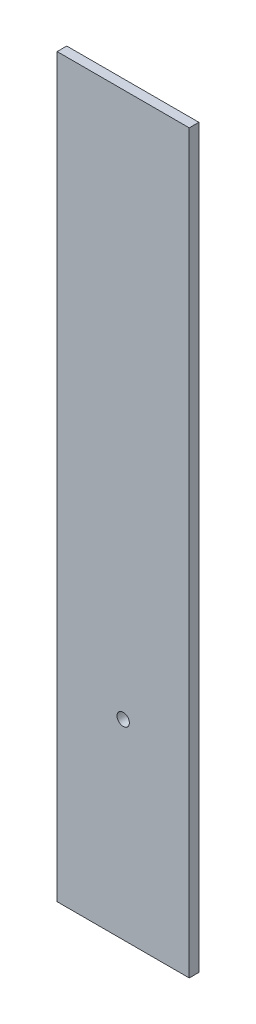
ISO-10303-21;
HEADER;
FILE_DESCRIPTION(('STEP AP214'),'2;1');
FILE_NAME('part.step','',(''),(''),'','','');
FILE_SCHEMA(('AUTOMOTIVE_DESIGN { 1 0 10303 214 1 1 1 1 }'));
ENDSEC;
DATA;
#1=APPLICATION_CONTEXT('core data for automotive mechanical design processes');
#2=APPLICATION_PROTOCOL_DEFINITION('international standard','automotive_design',2000,#1);
#3=PRODUCT_CONTEXT('',#1,'mechanical');
#4=PRODUCT('Part','Part','',(#3));
#5=PRODUCT_RELATED_PRODUCT_CATEGORY('part','',(#4));
#6=PRODUCT_DEFINITION_FORMATION('','',#4);
#7=PRODUCT_DEFINITION_CONTEXT('part definition',#1,'design');
#8=PRODUCT_DEFINITION('design','',#6,#7);
#9=PRODUCT_DEFINITION_SHAPE('','',#8);
#10=(LENGTH_UNIT() NAMED_UNIT(*) SI_UNIT(.MILLI.,.METRE.));
#11=(NAMED_UNIT(*) PLANE_ANGLE_UNIT() SI_UNIT($,.RADIAN.));
#12=(NAMED_UNIT(*) SI_UNIT($,.STERADIAN.) SOLID_ANGLE_UNIT());
#13=UNCERTAINTY_MEASURE_WITH_UNIT(LENGTH_MEASURE(1.E-05),#10,'distance_accuracy_value','');
#14=(GEOMETRIC_REPRESENTATION_CONTEXT(3) GLOBAL_UNCERTAINTY_ASSIGNED_CONTEXT((#13)) GLOBAL_UNIT_ASSIGNED_CONTEXT((#10,
#11,#12)) REPRESENTATION_CONTEXT('',''));
#15=CARTESIAN_POINT('',(0.,0.,0.));
#16=DIRECTION('',(0.,0.,1.));
#17=DIRECTION('',(1.,0.,0.));
#18=AXIS2_PLACEMENT_3D('',#15,#16,#17);
#19=CARTESIAN_POINT('',(0.,0.,4.953));
#20=DIRECTION('',(0.,0.,1.));
#21=DIRECTION('',(1.,0.,0.));
#22=AXIS2_PLACEMENT_3D('',#19,#20,#21);
#23=PLANE('',#22);
#24=DIRECTION('',(0.,-1.,0.));
#25=VECTOR('',#24,1.);
#26=CARTESIAN_POINT('',(-34.0000000000004,394.959461551983,4.953));
#27=LINE('',#26,#25);
#28=CARTESIAN_POINT('',(-34.0000000000004,394.959461551983,4.953));
#29=VERTEX_POINT('',#28);
#30=CARTESIAN_POINT('',(-34.0000000000003,16.,4.953));
#31=VERTEX_POINT('',#30);
#32=EDGE_CURVE('E85',#29,#31,#27,.T.);
#33=ORIENTED_EDGE('',*,*,#32,.T.);
#34=DIRECTION('',(1.,0.,0.));
#35=VECTOR('',#34,1.);
#36=CARTESIAN_POINT('',(-34.0000000000003,16.,4.953));
#37=LINE('',#36,#35);
#38=CARTESIAN_POINT('',(33.9999999999997,16.,4.953));
#39=VERTEX_POINT('',#38);
#40=EDGE_CURVE('E80',#31,#39,#37,.T.);
#41=ORIENTED_EDGE('',*,*,#40,.T.);
#42=DIRECTION('',(0.,1.,0.));
#43=VECTOR('',#42,1.);
#44=CARTESIAN_POINT('',(33.9999999999996,394.959461551983,4.953));
#45=LINE('',#44,#43);
#46=CARTESIAN_POINT('',(33.9999999999996,394.959461551983,4.953));
#47=VERTEX_POINT('',#46);
#48=EDGE_CURVE('E83',#39,#47,#45,.T.);
#49=ORIENTED_EDGE('',*,*,#48,.T.);
#50=DIRECTION('',(-1.,0.,0.));
#51=VECTOR('',#50,1.);
#52=CARTESIAN_POINT('',(-34.0000000000004,394.959461551983,4.953));
#53=LINE('',#52,#51);
#54=EDGE_CURVE('E50',#47,#29,#53,.T.);
#55=ORIENTED_EDGE('',*,*,#54,.T.);
#56=EDGE_LOOP('',(#33,#41,#49,#55));
#57=FACE_BOUND('',#56,.T.);
#58=CARTESIAN_POINT('',(0.,114.3,4.953));
#59=DIRECTION('',(0.,0.,1.));
#60=DIRECTION('',(1.,0.,0.));
#61=AXIS2_PLACEMENT_3D('',#58,#59,#60);
#62=CIRCLE('',#61,3.175);
#63=CARTESIAN_POINT('',(3.17499999999997,114.3,4.953));
#64=VERTEX_POINT('',#63);
#65=EDGE_CURVE('E100',#64,#64,#62,.T.);
#66=ORIENTED_EDGE('',*,*,#65,.F.);
#67=EDGE_LOOP('',(#66));
#68=FACE_BOUND('',#67,.T.);
#69=ADVANCED_FACE('F33',(#57,#68),#23,.T.);
#70=CARTESIAN_POINT('',(0.,0.,0.));
#71=DIRECTION('',(0.,0.,1.));
#72=DIRECTION('',(1.,0.,0.));
#73=AXIS2_PLACEMENT_3D('',#70,#71,#72);
#74=PLANE('',#73);
#75=DIRECTION('',(0.,-1.,0.));
#76=VECTOR('',#75,1.);
#77=CARTESIAN_POINT('',(-34.0000000000004,394.959461551983,0.));
#78=LINE('',#77,#76);
#79=CARTESIAN_POINT('',(-34.0000000000004,394.959461551983,0.));
#80=VERTEX_POINT('',#79);
#81=CARTESIAN_POINT('',(-34.0000000000003,16.,0.));
#82=VERTEX_POINT('',#81);
#83=EDGE_CURVE('E97',#80,#82,#78,.T.);
#84=ORIENTED_EDGE('',*,*,#83,.F.);
#85=DIRECTION('',(-1.,0.,0.));
#86=VECTOR('',#85,1.);
#87=CARTESIAN_POINT('',(-34.0000000000004,394.959461551983,0.));
#88=LINE('',#87,#86);
#89=CARTESIAN_POINT('',(33.9999999999996,394.959461551983,0.));
#90=VERTEX_POINT('',#89);
#91=EDGE_CURVE('E73',#90,#80,#88,.T.);
#92=ORIENTED_EDGE('',*,*,#91,.F.);
#93=DIRECTION('',(0.,1.,0.));
#94=VECTOR('',#93,1.);
#95=CARTESIAN_POINT('',(33.9999999999996,394.959461551983,0.));
#96=LINE('',#95,#94);
#97=CARTESIAN_POINT('',(33.9999999999997,16.,0.));
#98=VERTEX_POINT('',#97);
#99=EDGE_CURVE('E67',#98,#90,#96,.T.);
#100=ORIENTED_EDGE('',*,*,#99,.F.);
#101=DIRECTION('',(1.,0.,0.));
#102=VECTOR('',#101,1.);
#103=CARTESIAN_POINT('',(-34.0000000000003,16.,0.));
#104=LINE('',#103,#102);
#105=EDGE_CURVE('E89',#82,#98,#104,.T.);
#106=ORIENTED_EDGE('',*,*,#105,.F.);
#107=EDGE_LOOP('',(#84,#92,#100,#106));
#108=FACE_BOUND('',#107,.T.);
#109=CARTESIAN_POINT('',(0.,114.3,0.));
#110=DIRECTION('',(0.,0.,1.));
#111=DIRECTION('',(1.,0.,0.));
#112=AXIS2_PLACEMENT_3D('',#109,#110,#111);
#113=CIRCLE('',#112,3.175);
#114=CARTESIAN_POINT('',(3.17499999999997,114.3,0.));
#115=VERTEX_POINT('',#114);
#116=EDGE_CURVE('E112',#115,#115,#113,.T.);
#117=ORIENTED_EDGE('',*,*,#116,.T.);
#118=EDGE_LOOP('',(#117));
#119=FACE_BOUND('',#118,.T.);
#120=ADVANCED_FACE('F108',(#108,#119),#74,.F.);
#121=CARTESIAN_POINT('',(-34.0000000000004,394.959461551983,4.953));
#122=DIRECTION('',(1.,0.,0.));
#123=DIRECTION('',(0.,1.,0.));
#124=AXIS2_PLACEMENT_3D('',#121,#122,#123);
#125=PLANE('',#124);
#126=ORIENTED_EDGE('',*,*,#83,.T.);
#127=DIRECTION('',(0.,0.,-1.));
#128=VECTOR('',#127,1.);
#129=CARTESIAN_POINT('',(-34.0000000000003,16.,4.953));
#130=LINE('',#129,#128);
#131=EDGE_CURVE('E11',#31,#82,#130,.T.);
#132=ORIENTED_EDGE('',*,*,#131,.F.);
#133=ORIENTED_EDGE('',*,*,#32,.F.);
#134=DIRECTION('',(0.,0.,-1.));
#135=VECTOR('',#134,1.);
#136=CARTESIAN_POINT('',(-34.0000000000004,394.959461551983,4.953));
#137=LINE('',#136,#135);
#138=EDGE_CURVE('E93',#29,#80,#137,.T.);
#139=ORIENTED_EDGE('',*,*,#138,.T.);
#140=EDGE_LOOP('',(#126,#132,#133,#139));
#141=FACE_BOUND('',#140,.T.);
#142=ADVANCED_FACE('F35',(#141),#125,.F.);
#143=CARTESIAN_POINT('',(-34.0000000000003,16.,4.953));
#144=DIRECTION('',(0.,1.,0.));
#145=DIRECTION('',(-1.,0.,0.));
#146=AXIS2_PLACEMENT_3D('',#143,#144,#145);
#147=PLANE('',#146);
#148=ORIENTED_EDGE('',*,*,#105,.T.);
#149=DIRECTION('',(0.,0.,-1.));
#150=VECTOR('',#149,1.);
#151=CARTESIAN_POINT('',(33.9999999999997,16.,4.953));
#152=LINE('',#151,#150);
#153=EDGE_CURVE('E42',#39,#98,#152,.T.);
#154=ORIENTED_EDGE('',*,*,#153,.F.);
#155=ORIENTED_EDGE('',*,*,#40,.F.);
#156=ORIENTED_EDGE('',*,*,#131,.T.);
#157=EDGE_LOOP('',(#148,#154,#155,#156));
#158=FACE_BOUND('',#157,.T.);
#159=ADVANCED_FACE('F88',(#158),#147,.F.);
#160=CARTESIAN_POINT('',(33.9999999999996,394.959461551983,4.953));
#161=DIRECTION('',(-1.,0.,0.));
#162=DIRECTION('',(0.,-1.,0.));
#163=AXIS2_PLACEMENT_3D('',#160,#161,#162);
#164=PLANE('',#163);
#165=ORIENTED_EDGE('',*,*,#99,.T.);
#166=DIRECTION('',(0.,0.,-1.));
#167=VECTOR('',#166,1.);
#168=CARTESIAN_POINT('',(33.9999999999996,394.959461551983,4.953));
#169=LINE('',#168,#167);
#170=EDGE_CURVE('E90',#47,#90,#169,.T.);
#171=ORIENTED_EDGE('',*,*,#170,.F.);
#172=ORIENTED_EDGE('',*,*,#48,.F.);
#173=ORIENTED_EDGE('',*,*,#153,.T.);
#174=EDGE_LOOP('',(#165,#171,#172,#173));
#175=FACE_BOUND('',#174,.T.);
#176=ADVANCED_FACE('F91',(#175),#164,.F.);
#177=CARTESIAN_POINT('',(-34.0000000000004,394.959461551983,4.953));
#178=DIRECTION('',(0.,-1.,0.));
#179=DIRECTION('',(0.,0.,-1.));
#180=AXIS2_PLACEMENT_3D('',#177,#178,#179);
#181=PLANE('',#180);
#182=ORIENTED_EDGE('',*,*,#91,.T.);
#183=ORIENTED_EDGE('',*,*,#138,.F.);
#184=ORIENTED_EDGE('',*,*,#54,.F.);
#185=ORIENTED_EDGE('',*,*,#170,.T.);
#186=EDGE_LOOP('',(#182,#183,#184,#185));
#187=FACE_BOUND('',#186,.T.);
#188=ADVANCED_FACE('F105',(#187),#181,.F.);
#189=CARTESIAN_POINT('',(0.,114.3,4.953));
#190=DIRECTION('',(0.,0.,-1.));
#191=DIRECTION('',(-1.,0.,0.));
#192=AXIS2_PLACEMENT_3D('',#189,#190,#191);
#193=CYLINDRICAL_SURFACE('',#192,3.175);
#194=ORIENTED_EDGE('',*,*,#65,.T.);
#195=EDGE_LOOP('',(#194));
#196=FACE_BOUND('',#195,.T.);
#197=ORIENTED_EDGE('',*,*,#116,.F.);
#198=EDGE_LOOP('',(#197));
#199=FACE_BOUND('',#198,.T.);
#200=ADVANCED_FACE('F118',(#196,#199),#193,.F.);
#201=CLOSED_SHELL('',(#69,#120,#142,#159,#176,#188,#200));
#202=MANIFOLD_SOLID_BREP('B2',#201);
#203=ADVANCED_BREP_SHAPE_REPRESENTATION('',(#18,#202),#14);
#204=SHAPE_DEFINITION_REPRESENTATION(#9,#203);
ENDSEC;
END-ISO-10303-21;
